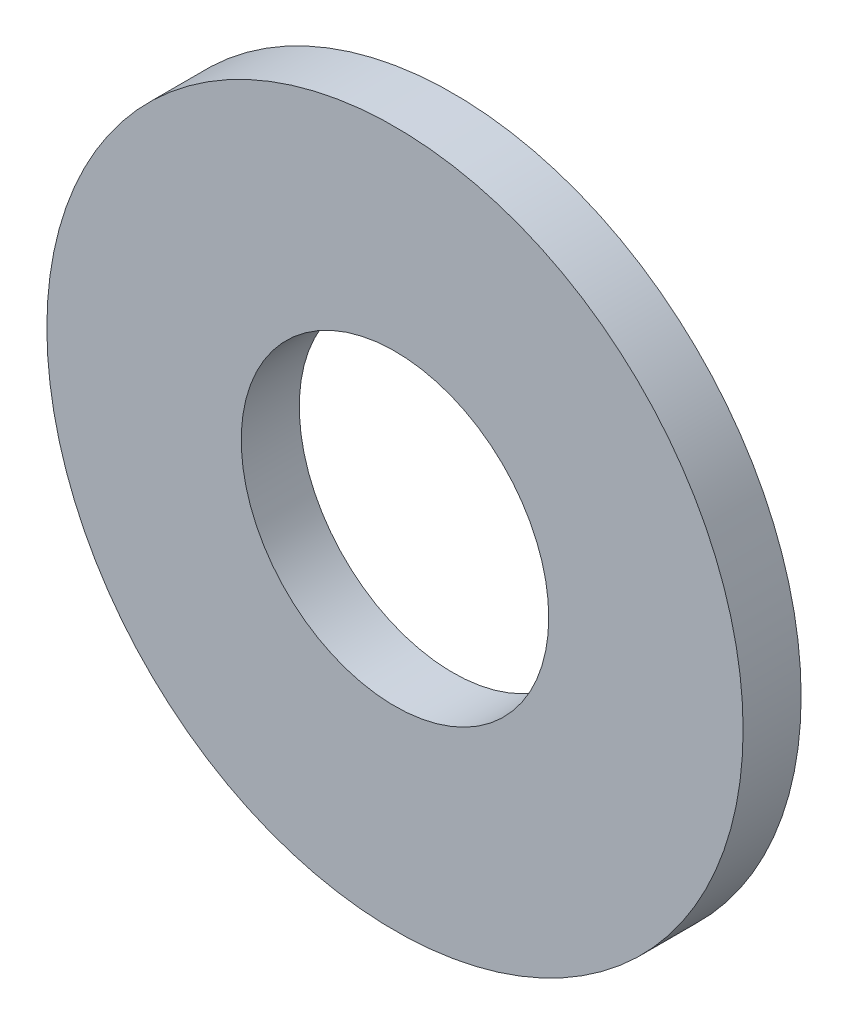
ISO-10303-21;
HEADER;
FILE_DESCRIPTION(('STEP AP214'),'2;1');
FILE_NAME('part.step','',(''),(''),'','','');
FILE_SCHEMA(('AUTOMOTIVE_DESIGN { 1 0 10303 214 1 1 1 1 }'));
ENDSEC;
DATA;
#1=APPLICATION_CONTEXT('core data for automotive mechanical design processes');
#2=APPLICATION_PROTOCOL_DEFINITION('international standard','automotive_design',2000,#1);
#3=PRODUCT_CONTEXT('',#1,'mechanical');
#4=PRODUCT('Part','Part','',(#3));
#5=PRODUCT_RELATED_PRODUCT_CATEGORY('part','',(#4));
#6=PRODUCT_DEFINITION_FORMATION('','',#4);
#7=PRODUCT_DEFINITION_CONTEXT('part definition',#1,'design');
#8=PRODUCT_DEFINITION('design','',#6,#7);
#9=PRODUCT_DEFINITION_SHAPE('','',#8);
#10=(LENGTH_UNIT() NAMED_UNIT(*) SI_UNIT(.MILLI.,.METRE.));
#11=(NAMED_UNIT(*) PLANE_ANGLE_UNIT() SI_UNIT($,.RADIAN.));
#12=(NAMED_UNIT(*) SI_UNIT($,.STERADIAN.) SOLID_ANGLE_UNIT());
#13=UNCERTAINTY_MEASURE_WITH_UNIT(LENGTH_MEASURE(1.E-05),#10,'distance_accuracy_value','');
#14=(GEOMETRIC_REPRESENTATION_CONTEXT(3) GLOBAL_UNCERTAINTY_ASSIGNED_CONTEXT((#13)) GLOBAL_UNIT_ASSIGNED_CONTEXT((#10,
#11,#12)) REPRESENTATION_CONTEXT('',''));
#15=CARTESIAN_POINT('',(0.,0.,0.));
#16=DIRECTION('',(0.,0.,1.));
#17=DIRECTION('',(1.,0.,0.));
#18=AXIS2_PLACEMENT_3D('',#15,#16,#17);
#19=CARTESIAN_POINT('',(0.,0.,1.));
#20=DIRECTION('',(0.,0.,1.));
#21=DIRECTION('',(1.,0.,0.));
#22=AXIS2_PLACEMENT_3D('',#19,#20,#21);
#23=PLANE('',#22);
#24=CARTESIAN_POINT('',(0.,0.,1.));
#25=DIRECTION('',(0.,0.,1.));
#26=DIRECTION('',(1.,0.,0.));
#27=AXIS2_PLACEMENT_3D('',#24,#25,#26);
#28=CIRCLE('',#27,6.);
#29=CARTESIAN_POINT('',(6.,0.,1.));
#30=VERTEX_POINT('',#29);
#31=EDGE_CURVE('E10',#30,#30,#28,.T.);
#32=ORIENTED_EDGE('',*,*,#31,.T.);
#33=EDGE_LOOP('',(#32));
#34=FACE_BOUND('',#33,.T.);
#35=CARTESIAN_POINT('',(0.,0.,1.));
#36=DIRECTION('',(0.,0.,1.));
#37=DIRECTION('',(1.,0.,0.));
#38=AXIS2_PLACEMENT_3D('',#35,#36,#37);
#39=CIRCLE('',#38,2.65);
#40=CARTESIAN_POINT('',(2.65,0.,1.));
#41=VERTEX_POINT('',#40);
#42=EDGE_CURVE('E41',#41,#41,#39,.T.);
#43=ORIENTED_EDGE('',*,*,#42,.F.);
#44=EDGE_LOOP('',(#43));
#45=FACE_BOUND('',#44,.T.);
#46=ADVANCED_FACE('F30',(#34,#45),#23,.T.);
#47=CARTESIAN_POINT('',(0.,0.,0.));
#48=DIRECTION('',(0.,0.,1.));
#49=DIRECTION('',(1.,0.,0.));
#50=AXIS2_PLACEMENT_3D('',#47,#48,#49);
#51=PLANE('',#50);
#52=CARTESIAN_POINT('',(0.,0.,0.));
#53=DIRECTION('',(0.,0.,1.));
#54=DIRECTION('',(1.,0.,0.));
#55=AXIS2_PLACEMENT_3D('',#52,#53,#54);
#56=CIRCLE('',#55,6.);
#57=CARTESIAN_POINT('',(6.,0.,0.));
#58=VERTEX_POINT('',#57);
#59=EDGE_CURVE('E37',#58,#58,#56,.T.);
#60=ORIENTED_EDGE('',*,*,#59,.F.);
#61=EDGE_LOOP('',(#60));
#62=FACE_BOUND('',#61,.T.);
#63=CARTESIAN_POINT('',(0.,0.,0.));
#64=DIRECTION('',(0.,0.,1.));
#65=DIRECTION('',(1.,0.,0.));
#66=AXIS2_PLACEMENT_3D('',#63,#64,#65);
#67=CIRCLE('',#66,2.65);
#68=CARTESIAN_POINT('',(2.65,0.,0.));
#69=VERTEX_POINT('',#68);
#70=EDGE_CURVE('E45',#69,#69,#67,.T.);
#71=ORIENTED_EDGE('',*,*,#70,.T.);
#72=EDGE_LOOP('',(#71));
#73=FACE_BOUND('',#72,.T.);
#74=ADVANCED_FACE('F51',(#62,#73),#51,.F.);
#75=CARTESIAN_POINT('',(0.,0.,1.));
#76=DIRECTION('',(0.,0.,-1.));
#77=DIRECTION('',(-1.,0.,0.));
#78=AXIS2_PLACEMENT_3D('',#75,#76,#77);
#79=CYLINDRICAL_SURFACE('',#78,6.);
#80=ORIENTED_EDGE('',*,*,#31,.F.);
#81=EDGE_LOOP('',(#80));
#82=FACE_BOUND('',#81,.T.);
#83=ORIENTED_EDGE('',*,*,#59,.T.);
#84=EDGE_LOOP('',(#83));
#85=FACE_BOUND('',#84,.T.);
#86=ADVANCED_FACE('F32',(#82,#85),#79,.T.);
#87=CARTESIAN_POINT('',(0.,0.,1.));
#88=DIRECTION('',(0.,0.,-1.));
#89=DIRECTION('',(-1.,0.,0.));
#90=AXIS2_PLACEMENT_3D('',#87,#88,#89);
#91=CYLINDRICAL_SURFACE('',#90,2.65);
#92=ORIENTED_EDGE('',*,*,#42,.T.);
#93=EDGE_LOOP('',(#92));
#94=FACE_BOUND('',#93,.T.);
#95=ORIENTED_EDGE('',*,*,#70,.F.);
#96=EDGE_LOOP('',(#95));
#97=FACE_BOUND('',#96,.T.);
#98=ADVANCED_FACE('F53',(#94,#97),#91,.F.);
#99=CLOSED_SHELL('',(#46,#74,#86,#98));
#100=MANIFOLD_SOLID_BREP('B2',#99);
#101=ADVANCED_BREP_SHAPE_REPRESENTATION('',(#18,#100),#14);
#102=SHAPE_DEFINITION_REPRESENTATION(#9,#101);
ENDSEC;
END-ISO-10303-21;
